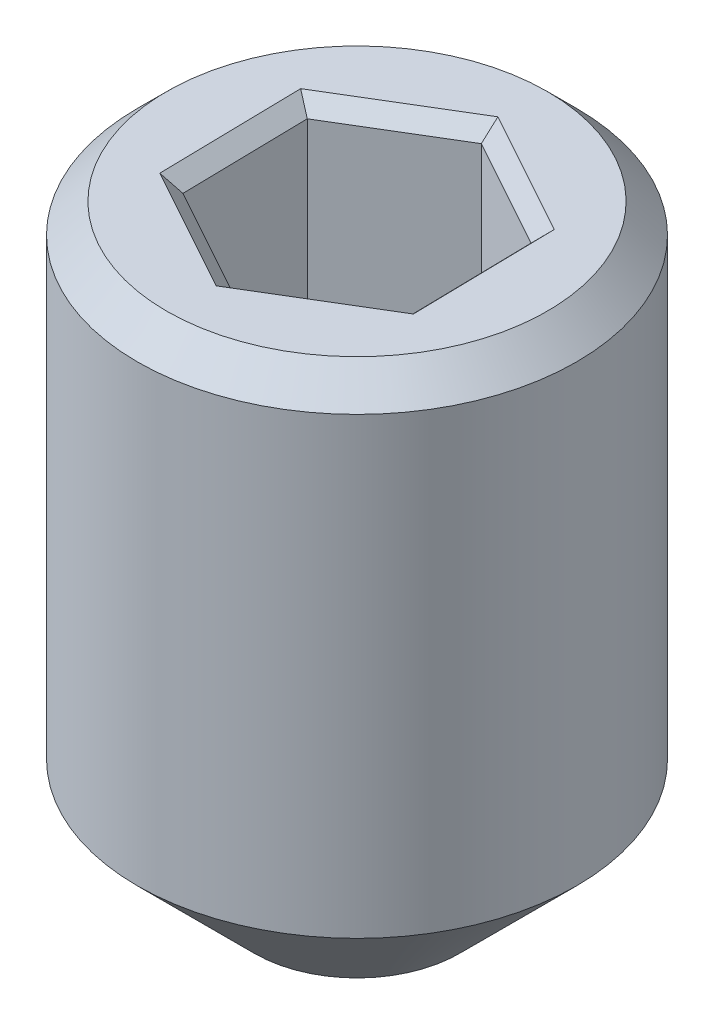
ISO-10303-21;
HEADER;
FILE_DESCRIPTION(('STEP AP214'),'2;1');
FILE_NAME('part.step','',(''),(''),'','','');
FILE_SCHEMA(('AUTOMOTIVE_DESIGN { 1 0 10303 214 1 1 1 1 }'));
ENDSEC;
DATA;
#1=APPLICATION_CONTEXT('core data for automotive mechanical design processes');
#2=APPLICATION_PROTOCOL_DEFINITION('international standard','automotive_design',2000,#1);
#3=PRODUCT_CONTEXT('',#1,'mechanical');
#4=PRODUCT('Part','Part','',(#3));
#5=PRODUCT_RELATED_PRODUCT_CATEGORY('part','',(#4));
#6=PRODUCT_DEFINITION_FORMATION('','',#4);
#7=PRODUCT_DEFINITION_CONTEXT('part definition',#1,'design');
#8=PRODUCT_DEFINITION('design','',#6,#7);
#9=PRODUCT_DEFINITION_SHAPE('','',#8);
#10=(LENGTH_UNIT() NAMED_UNIT(*) SI_UNIT(.MILLI.,.METRE.));
#11=(NAMED_UNIT(*) PLANE_ANGLE_UNIT() SI_UNIT($,.RADIAN.));
#12=(NAMED_UNIT(*) SI_UNIT($,.STERADIAN.) SOLID_ANGLE_UNIT());
#13=UNCERTAINTY_MEASURE_WITH_UNIT(LENGTH_MEASURE(1.E-05),#10,'distance_accuracy_value','');
#14=(GEOMETRIC_REPRESENTATION_CONTEXT(3) GLOBAL_UNCERTAINTY_ASSIGNED_CONTEXT((#13)) GLOBAL_UNIT_ASSIGNED_CONTEXT((#10,
#11,#12)) REPRESENTATION_CONTEXT('',''));
#15=CARTESIAN_POINT('',(0.,0.,0.));
#16=DIRECTION('',(0.,0.,1.));
#17=DIRECTION('',(1.,0.,0.));
#18=AXIS2_PLACEMENT_3D('',#15,#16,#17);
#19=CARTESIAN_POINT('',(0.,4.1,0.));
#20=DIRECTION('',(0.,-1.,0.));
#21=DIRECTION('',(0.,0.,-1.));
#22=AXIS2_PLACEMENT_3D('',#19,#20,#21);
#23=CYLINDRICAL_SURFACE('',#22,1.5);
#24=CARTESIAN_POINT('',(0.,0.799999999999999,0.));
#25=DIRECTION('',(0.,1.,0.));
#26=DIRECTION('',(0.,0.,1.));
#27=AXIS2_PLACEMENT_3D('',#24,#25,#26);
#28=CIRCLE('',#27,1.5);
#29=CARTESIAN_POINT('',(0.,0.799999999999999,1.5));
#30=VERTEX_POINT('',#29);
#31=EDGE_CURVE('E41',#30,#30,#28,.T.);
#32=ORIENTED_EDGE('',*,*,#31,.T.);
#33=EDGE_LOOP('',(#32));
#34=FACE_BOUND('',#33,.T.);
#35=CARTESIAN_POINT('',(0.,3.9,0.));
#36=DIRECTION('',(0.,1.,0.));
#37=DIRECTION('',(0.,0.,1.));
#38=AXIS2_PLACEMENT_3D('',#35,#36,#37);
#39=CIRCLE('',#38,1.5);
#40=CARTESIAN_POINT('',(0.,3.9,1.5));
#41=VERTEX_POINT('',#40);
#42=EDGE_CURVE('E162',#41,#41,#39,.F.);
#43=ORIENTED_EDGE('',*,*,#42,.T.);
#44=EDGE_LOOP('',(#43));
#45=FACE_BOUND('',#44,.T.);
#46=ADVANCED_FACE('F33',(#34,#45),#23,.T.);
#47=CARTESIAN_POINT('',(0.,4.1,0.));
#48=DIRECTION('',(0.,1.,0.));
#49=DIRECTION('',(0.,0.,1.));
#50=AXIS2_PLACEMENT_3D('',#47,#48,#49);
#51=PLANE('',#50);
#52=DIRECTION('',(-0.875489199042184,0.,-0.483237687231113));
#53=VECTOR('',#52,1.);
#54=CARTESIAN_POINT('',(-0.789849977701157,4.1,0.534917762581765));
#55=LINE('',#54,#53);
#56=CARTESIAN_POINT('',(0.018892301882227,4.1,0.981313616670493));
#57=VERTEX_POINT('',#56);
#58=CARTESIAN_POINT('',(-0.840396370175118,4.1,0.50701802170122));
#59=VERTEX_POINT('',#58);
#60=EDGE_CURVE('E176',#57,#59,#55,.T.);
#61=ORIENTED_EDGE('',*,*,#60,.T.);
#62=DIRECTION('',(-0.0192484863129093,0.,-0.999814730724979));
#63=VECTOR('',#62,1.);
#64=CARTESIAN_POINT('',(-0.85817736018192,4.1,-0.416571264576892));
#65=LINE('',#64,#63);
#66=CARTESIAN_POINT('',(-0.859288672057345,4.1,-0.474295594969274));
#67=VERTEX_POINT('',#66);
#68=EDGE_CURVE('E147',#59,#67,#65,.T.);
#69=ORIENTED_EDGE('',*,*,#68,.T.);
#70=DIRECTION('',(0.856240712729275,0.,-0.516577043493866));
#71=VECTOR('',#70,1.);
#72=CARTESIAN_POINT('',(-0.0683273824807632,4.1,-0.951489027158657));
#73=LINE('',#72,#71);
#74=CARTESIAN_POINT('',(-0.0188923018822269,4.1,-0.981313616670493));
#75=VERTEX_POINT('',#74);
#76=EDGE_CURVE('E161',#67,#75,#73,.T.);
#77=ORIENTED_EDGE('',*,*,#76,.T.);
#78=DIRECTION('',(0.875489199042184,0.,0.483237687231113));
#79=VECTOR('',#78,1.);
#80=CARTESIAN_POINT('',(0.789849977701157,4.1,-0.534917762581765));
#81=LINE('',#80,#79);
#82=CARTESIAN_POINT('',(0.840396370175118,4.1,-0.50701802170122));
#83=VERTEX_POINT('',#82);
#84=EDGE_CURVE('E164',#75,#83,#81,.T.);
#85=ORIENTED_EDGE('',*,*,#84,.T.);
#86=DIRECTION('',(0.0192484863129097,0.,0.999814730724979));
#87=VECTOR('',#86,1.);
#88=CARTESIAN_POINT('',(0.85817736018192,4.1,0.416571264576891));
#89=LINE('',#88,#87);
#90=CARTESIAN_POINT('',(0.859288672057346,4.1,0.474295594969273));
#91=VERTEX_POINT('',#90);
#92=EDGE_CURVE('E172',#83,#91,#89,.T.);
#93=ORIENTED_EDGE('',*,*,#92,.T.);
#94=DIRECTION('',(-0.856240712729275,0.,0.516577043493866));
#95=VECTOR('',#94,1.);
#96=CARTESIAN_POINT('',(0.0683273824807633,4.1,0.951489027158657));
#97=LINE('',#96,#95);
#98=EDGE_CURVE('E174',#91,#57,#97,.T.);
#99=ORIENTED_EDGE('',*,*,#98,.T.);
#100=EDGE_LOOP('',(#61,#69,#77,#85,#93,#99));
#101=FACE_BOUND('',#100,.T.);
#102=CARTESIAN_POINT('',(0.,4.1,0.));
#103=DIRECTION('',(0.,1.,0.));
#104=DIRECTION('',(0.,0.,1.));
#105=AXIS2_PLACEMENT_3D('',#102,#103,#104);
#106=CIRCLE('',#105,1.3);
#107=CARTESIAN_POINT('',(0.,4.1,1.3));
#108=VERTEX_POINT('',#107);
#109=EDGE_CURVE('E167',#108,#108,#106,.T.);
#110=ORIENTED_EDGE('',*,*,#109,.T.);
#111=EDGE_LOOP('',(#110));
#112=FACE_BOUND('',#111,.T.);
#113=ADVANCED_FACE('F253',(#101,#112),#51,.T.);
#114=CARTESIAN_POINT('',(0.,0.,0.));
#115=DIRECTION('',(0.,1.,0.));
#116=DIRECTION('',(0.,0.,1.));
#117=AXIS2_PLACEMENT_3D('',#114,#115,#116);
#118=PLANE('',#117);
#119=CARTESIAN_POINT('',(0.,0.,0.));
#120=DIRECTION('',(0.,1.,0.));
#121=DIRECTION('',(0.,0.,1.));
#122=AXIS2_PLACEMENT_3D('',#119,#120,#121);
#123=CIRCLE('',#122,0.699999999999997);
#124=CARTESIAN_POINT('',(0.,0.,0.699999999999997));
#125=VERTEX_POINT('',#124);
#126=EDGE_CURVE('E11',#125,#125,#123,.F.);
#127=ORIENTED_EDGE('',*,*,#126,.T.);
#128=EDGE_LOOP('',(#127));
#129=FACE_BOUND('',#128,.T.);
#130=ADVANCED_FACE('F258',(#129),#118,.F.);
#131=CARTESIAN_POINT('',(0.0166696781313767,2.1,0.865864955885729));
#132=DIRECTION('',(0.516577043493866,0.,0.856240712729275));
#133=DIRECTION('',(0.856240712729275,0.,-0.516577043493866));
#134=AXIS2_PLACEMENT_3D('',#131,#132,#133);
#135=PLANE('',#134);
#136=DIRECTION('',(0.,1.,0.));
#137=VECTOR('',#136,1.);
#138=CARTESIAN_POINT('',(0.758195887109423,2.1,0.418496113208182));
#139=LINE('',#138,#137);
#140=CARTESIAN_POINT('',(0.758195887109423,2.7,0.418496113208182));
#141=VERTEX_POINT('',#140);
#142=CARTESIAN_POINT('',(0.758195887109423,4.,0.418496113208182));
#143=VERTEX_POINT('',#142);
#144=EDGE_CURVE('E201',#141,#143,#139,.T.);
#145=ORIENTED_EDGE('',*,*,#144,.F.);
#146=DIRECTION('',(0.856240712729275,0.,-0.516577043493866));
#147=VECTOR('',#146,1.);
#148=CARTESIAN_POINT('',(0.0166696781313767,2.7,0.865864955885729));
#149=LINE('',#148,#147);
#150=CARTESIAN_POINT('',(0.0166696781313767,2.7,0.865864955885729));
#151=VERTEX_POINT('',#150);
#152=EDGE_CURVE('E217',#141,#151,#149,.F.);
#153=ORIENTED_EDGE('',*,*,#152,.T.);
#154=DIRECTION('',(0.,1.,0.));
#155=VECTOR('',#154,1.);
#156=CARTESIAN_POINT('',(0.0166696781313767,2.1,0.865864955885729));
#157=LINE('',#156,#155);
#158=CARTESIAN_POINT('',(0.0166696781313767,4.,0.865864955885729));
#159=VERTEX_POINT('',#158);
#160=EDGE_CURVE('E136',#151,#159,#157,.T.);
#161=ORIENTED_EDGE('',*,*,#160,.T.);
#162=DIRECTION('',(0.856240712729275,0.,-0.516577043493866));
#163=VECTOR('',#162,1.);
#164=CARTESIAN_POINT('',(0.758195887109423,4.,0.418496113208182));
#165=LINE('',#164,#163);
#166=EDGE_CURVE('E157',#159,#143,#165,.T.);
#167=ORIENTED_EDGE('',*,*,#166,.T.);
#168=EDGE_LOOP('',(#145,#153,#161,#167));
#169=FACE_BOUND('',#168,.T.);
#170=ADVANCED_FACE('F316',(#169),#135,.F.);
#171=CARTESIAN_POINT('',(-0.741526208978046,2.1,0.447368842677547));
#172=DIRECTION('',(-0.483237687231113,0.,0.875489199042184));
#173=DIRECTION('',(0.875489199042184,0.,0.483237687231113));
#174=AXIS2_PLACEMENT_3D('',#171,#172,#173);
#175=PLANE('',#174);
#176=ORIENTED_EDGE('',*,*,#160,.F.);
#177=DIRECTION('',(0.875489199042184,0.,0.483237687231113));
#178=VECTOR('',#177,1.);
#179=CARTESIAN_POINT('',(-0.741526208978046,2.7,0.447368842677547));
#180=LINE('',#179,#178);
#181=CARTESIAN_POINT('',(-0.741526208978046,2.7,0.447368842677547));
#182=VERTEX_POINT('',#181);
#183=EDGE_CURVE('E131',#151,#182,#180,.F.);
#184=ORIENTED_EDGE('',*,*,#183,.T.);
#185=DIRECTION('',(0.,1.,0.));
#186=VECTOR('',#185,1.);
#187=CARTESIAN_POINT('',(-0.741526208978046,2.1,0.447368842677547));
#188=LINE('',#187,#186);
#189=CARTESIAN_POINT('',(-0.741526208978046,4.,0.447368842677547));
#190=VERTEX_POINT('',#189);
#191=EDGE_CURVE('E123',#182,#190,#188,.T.);
#192=ORIENTED_EDGE('',*,*,#191,.T.);
#193=DIRECTION('',(0.875489199042184,0.,0.483237687231113));
#194=VECTOR('',#193,1.);
#195=CARTESIAN_POINT('',(0.0166696781313767,4.,0.865864955885729));
#196=LINE('',#195,#194);
#197=EDGE_CURVE('E128',#190,#159,#196,.T.);
#198=ORIENTED_EDGE('',*,*,#197,.T.);
#199=EDGE_LOOP('',(#176,#184,#192,#198));
#200=FACE_BOUND('',#199,.T.);
#201=ADVANCED_FACE('F126',(#200),#175,.F.);
#202=CARTESIAN_POINT('',(-0.758195887109422,2.1,-0.418496113208182));
#203=DIRECTION('',(-0.999814730724979,0.,0.0192484863129093));
#204=DIRECTION('',(0.0192484863129093,0.,0.999814730724979));
#205=AXIS2_PLACEMENT_3D('',#202,#203,#204);
#206=PLANE('',#205);
#207=ORIENTED_EDGE('',*,*,#191,.F.);
#208=DIRECTION('',(0.0192484863129093,0.,0.999814730724979));
#209=VECTOR('',#208,1.);
#210=CARTESIAN_POINT('',(-0.758195887109422,2.7,-0.418496113208182));
#211=LINE('',#210,#209);
#212=CARTESIAN_POINT('',(-0.758195887109422,2.7,-0.418496113208182));
#213=VERTEX_POINT('',#212);
#214=EDGE_CURVE('E214',#182,#213,#211,.F.);
#215=ORIENTED_EDGE('',*,*,#214,.T.);
#216=DIRECTION('',(0.,1.,0.));
#217=VECTOR('',#216,1.);
#218=CARTESIAN_POINT('',(-0.758195887109422,2.1,-0.418496113208182));
#219=LINE('',#218,#217);
#220=CARTESIAN_POINT('',(-0.758195887109422,4.,-0.418496113208182));
#221=VERTEX_POINT('',#220);
#222=EDGE_CURVE('E137',#213,#221,#219,.T.);
#223=ORIENTED_EDGE('',*,*,#222,.T.);
#224=DIRECTION('',(0.0192484863129093,0.,0.999814730724979));
#225=VECTOR('',#224,1.);
#226=CARTESIAN_POINT('',(-0.741526208978046,4.,0.447368842677547));
#227=LINE('',#226,#225);
#228=EDGE_CURVE('E145',#221,#190,#227,.T.);
#229=ORIENTED_EDGE('',*,*,#228,.T.);
#230=EDGE_LOOP('',(#207,#215,#223,#229));
#231=FACE_BOUND('',#230,.T.);
#232=ADVANCED_FACE('F159',(#231),#206,.F.);
#233=CARTESIAN_POINT('',(-0.0166696781313765,2.1,-0.865864955885729));
#234=DIRECTION('',(-0.516577043493866,0.,-0.856240712729275));
#235=DIRECTION('',(-0.856240712729275,0.,0.516577043493866));
#236=AXIS2_PLACEMENT_3D('',#233,#234,#235);
#237=PLANE('',#236);
#238=ORIENTED_EDGE('',*,*,#222,.F.);
#239=DIRECTION('',(-0.856240712729275,0.,0.516577043493866));
#240=VECTOR('',#239,1.);
#241=CARTESIAN_POINT('',(-0.0166696781313765,2.7,-0.865864955885729));
#242=LINE('',#241,#240);
#243=CARTESIAN_POINT('',(-0.0166696781313765,2.7,-0.865864955885729));
#244=VERTEX_POINT('',#243);
#245=EDGE_CURVE('E48',#213,#244,#242,.F.);
#246=ORIENTED_EDGE('',*,*,#245,.T.);
#247=DIRECTION('',(0.,1.,0.));
#248=VECTOR('',#247,1.);
#249=CARTESIAN_POINT('',(-0.0166696781313765,2.1,-0.865864955885729));
#250=LINE('',#249,#248);
#251=CARTESIAN_POINT('',(-0.0166696781313765,4.,-0.865864955885729));
#252=VERTEX_POINT('',#251);
#253=EDGE_CURVE('E321',#244,#252,#250,.T.);
#254=ORIENTED_EDGE('',*,*,#253,.T.);
#255=DIRECTION('',(-0.856240712729275,0.,0.516577043493866));
#256=VECTOR('',#255,1.);
#257=CARTESIAN_POINT('',(-0.758195887109422,4.,-0.418496113208182));
#258=LINE('',#257,#256);
#259=EDGE_CURVE('E187',#252,#221,#258,.T.);
#260=ORIENTED_EDGE('',*,*,#259,.T.);
#261=EDGE_LOOP('',(#238,#246,#254,#260));
#262=FACE_BOUND('',#261,.T.);
#263=ADVANCED_FACE('F346',(#262),#237,.F.);
#264=CARTESIAN_POINT('',(0.741526208978046,2.1,-0.447368842677547));
#265=DIRECTION('',(0.483237687231113,0.,-0.875489199042184));
#266=DIRECTION('',(-0.875489199042184,0.,-0.483237687231113));
#267=AXIS2_PLACEMENT_3D('',#264,#265,#266);
#268=PLANE('',#267);
#269=ORIENTED_EDGE('',*,*,#253,.F.);
#270=DIRECTION('',(-0.875489199042184,0.,-0.483237687231113));
#271=VECTOR('',#270,1.);
#272=CARTESIAN_POINT('',(0.741526208978046,2.7,-0.447368842677547));
#273=LINE('',#272,#271);
#274=CARTESIAN_POINT('',(0.741526208978046,2.7,-0.447368842677547));
#275=VERTEX_POINT('',#274);
#276=EDGE_CURVE('E55',#244,#275,#273,.F.);
#277=ORIENTED_EDGE('',*,*,#276,.T.);
#278=DIRECTION('',(0.,1.,0.));
#279=VECTOR('',#278,1.);
#280=CARTESIAN_POINT('',(0.741526208978046,2.1,-0.447368842677547));
#281=LINE('',#280,#279);
#282=CARTESIAN_POINT('',(0.741526208978046,4.,-0.447368842677547));
#283=VERTEX_POINT('',#282);
#284=EDGE_CURVE('E323',#275,#283,#281,.T.);
#285=ORIENTED_EDGE('',*,*,#284,.T.);
#286=DIRECTION('',(-0.875489199042184,0.,-0.483237687231113));
#287=VECTOR('',#286,1.);
#288=CARTESIAN_POINT('',(-0.0166696781313765,4.,-0.865864955885729));
#289=LINE('',#288,#287);
#290=EDGE_CURVE('E184',#283,#252,#289,.T.);
#291=ORIENTED_EDGE('',*,*,#290,.T.);
#292=EDGE_LOOP('',(#269,#277,#285,#291));
#293=FACE_BOUND('',#292,.T.);
#294=ADVANCED_FACE('F337',(#293),#268,.F.);
#295=CARTESIAN_POINT('',(0.758195887109423,2.1,0.418496113208182));
#296=DIRECTION('',(0.999814730724979,0.,-0.0192484863129097));
#297=DIRECTION('',(-0.0192484863129097,0.,-0.999814730724979));
#298=AXIS2_PLACEMENT_3D('',#295,#296,#297);
#299=PLANE('',#298);
#300=ORIENTED_EDGE('',*,*,#284,.F.);
#301=DIRECTION('',(-0.0192484863129097,0.,-0.999814730724979));
#302=VECTOR('',#301,1.);
#303=CARTESIAN_POINT('',(0.758195887109423,2.7,0.418496113208182));
#304=LINE('',#303,#302);
#305=EDGE_CURVE('E219',#275,#141,#304,.F.);
#306=ORIENTED_EDGE('',*,*,#305,.T.);
#307=ORIENTED_EDGE('',*,*,#144,.T.);
#308=DIRECTION('',(-0.0192484863129097,0.,-0.999814730724979));
#309=VECTOR('',#308,1.);
#310=CARTESIAN_POINT('',(0.741526208978046,4.,-0.447368842677547));
#311=LINE('',#310,#309);
#312=EDGE_CURVE('E181',#143,#283,#311,.T.);
#313=ORIENTED_EDGE('',*,*,#312,.T.);
#314=EDGE_LOOP('',(#300,#306,#307,#313));
#315=FACE_BOUND('',#314,.T.);
#316=ADVANCED_FACE('F326',(#315),#299,.F.);
#317=CARTESIAN_POINT('',(0.758195887109423,2.1,0.418496113208182));
#318=DIRECTION('',(0.,1.,0.));
#319=DIRECTION('',(0.,0.,1.));
#320=AXIS2_PLACEMENT_3D('',#317,#318,#319);
#321=PLANE('',#320);
#322=DIRECTION('',(-0.856240712729275,0.,0.516577043493866));
#323=VECTOR('',#322,1.);
#324=CARTESIAN_POINT('',(0.293276547964943,2.1,-0.352120528248165));
#325=LINE('',#324,#323);
#326=CARTESIAN_POINT('',(-0.00333393562627531,2.1,-0.173172991177146));
#327=VERTEX_POINT('',#326);
#328=CARTESIAN_POINT('',(-0.151639177421885,2.1,-0.0836992226416365));
#329=VERTEX_POINT('',#328);
#330=EDGE_CURVE('E188',#327,#329,#325,.T.);
#331=ORIENTED_EDGE('',*,*,#330,.T.);
#332=DIRECTION('',(0.0192484863129093,0.,0.999814730724979));
#333=VECTOR('',#332,1.);
#334=CARTESIAN_POINT('',(-0.141637370543058,2.1,0.435819750889801));
#335=LINE('',#334,#333);
#336=CARTESIAN_POINT('',(-0.148305241795609,2.1,0.0894737685355091));
#337=VERTEX_POINT('',#336);
#338=EDGE_CURVE('E211',#329,#337,#335,.T.);
#339=ORIENTED_EDGE('',*,*,#338,.T.);
#340=DIRECTION('',(0.875489199042184,0.,0.483237687231113));
#341=VECTOR('',#340,1.);
#342=CARTESIAN_POINT('',(0.685710234024756,2.1,0.54981949306451));
#343=LINE('',#342,#341);
#344=CARTESIAN_POINT('',(0.00333393562627543,2.1,0.173172991177146));
#345=VERTEX_POINT('',#344);
#346=EDGE_CURVE('E209',#337,#345,#343,.T.);
#347=ORIENTED_EDGE('',*,*,#346,.T.);
#348=DIRECTION('',(0.856240712729275,0.,-0.516577043493866));
#349=VECTOR('',#348,1.);
#350=CARTESIAN_POINT('',(0.448249661013103,2.1,-0.0952483144293826));
#351=LINE('',#350,#349);
#352=CARTESIAN_POINT('',(0.151639177421885,2.1,0.0836992226416362));
#353=VERTEX_POINT('',#352);
#354=EDGE_CURVE('E207',#345,#353,#351,.T.);
#355=ORIENTED_EDGE('',*,*,#354,.T.);
#356=DIRECTION('',(-0.0192484863129097,0.,-0.999814730724979));
#357=VECTOR('',#356,1.);
#358=CARTESIAN_POINT('',(0.158307048674435,2.1,0.430045204995928));
#359=LINE('',#358,#357);
#360=CARTESIAN_POINT('',(0.148305241795609,2.1,-0.0894737685355093));
#361=VERTEX_POINT('',#360);
#362=EDGE_CURVE('E205',#353,#361,#359,.T.);
#363=ORIENTED_EDGE('',*,*,#362,.T.);
#364=DIRECTION('',(-0.875489199042184,0.,-0.483237687231113));
#365=VECTOR('',#364,1.);
#366=CARTESIAN_POINT('',(0.830681540194089,2.1,0.287172733351855));
#367=LINE('',#366,#365);
#368=EDGE_CURVE('E203',#361,#327,#367,.T.);
#369=ORIENTED_EDGE('',*,*,#368,.T.);
#370=EDGE_LOOP('',(#331,#339,#347,#355,#363,#369));
#371=FACE_BOUND('',#370,.T.);
#372=ADVANCED_FACE('F267',(#371),#321,.T.);
#373=CARTESIAN_POINT('',(0.,4.1,0.));
#374=DIRECTION('',(0.,-1.,0.));
#375=DIRECTION('',(0.,0.,-1.));
#376=AXIS2_PLACEMENT_3D('',#373,#374,#375);
#377=CONICAL_SURFACE('',#376,1.3,0.785398163397443);
#378=ORIENTED_EDGE('',*,*,#42,.F.);
#379=EDGE_LOOP('',(#378));
#380=FACE_BOUND('',#379,.T.);
#381=ORIENTED_EDGE('',*,*,#109,.F.);
#382=EDGE_LOOP('',(#381));
#383=FACE_BOUND('',#382,.T.);
#384=ADVANCED_FACE('F263',(#380,#383),#377,.T.);
#385=CARTESIAN_POINT('',(0.758195887109423,4.,0.418496113208182));
#386=DIRECTION('',(-0.706975776025836,0.707106781186546,0.0136107351994349));
#387=DIRECTION('',(-0.707172286800526,-0.707041269503638,0.));
#388=AXIS2_PLACEMENT_3D('',#385,#386,#387);
#389=PLANE('',#388);
#390=DIRECTION('',(0.661807627482498,0.654653670707978,0.365293355585011));
#391=VECTOR('',#390,1.);
#392=CARTESIAN_POINT('',(0.541568490792446,3.78571428571429,0.298925795148702));
#393=LINE('',#392,#391);
#394=EDGE_CURVE('E195',#91,#143,#393,.F.);
#395=ORIENTED_EDGE('',*,*,#394,.F.);
#396=ORIENTED_EDGE('',*,*,#92,.F.);
#397=DIRECTION('',(0.647257139511529,0.654653670707978,-0.390495540025648));
#398=VECTOR('',#397,1.);
#399=CARTESIAN_POINT('',(0.529661577841462,3.78571428571428,-0.319549173341104));
#400=LINE('',#399,#398);
#401=EDGE_CURVE('E198',#283,#83,#400,.T.);
#402=ORIENTED_EDGE('',*,*,#401,.F.);
#403=ORIENTED_EDGE('',*,*,#312,.F.);
#404=EDGE_LOOP('',(#395,#396,#402,#403));
#405=FACE_BOUND('',#404,.T.);
#406=ADVANCED_FACE('F266',(#405),#389,.T.);
#407=CARTESIAN_POINT('',(0.741526208978046,4.,-0.447368842677547));
#408=DIRECTION('',(-0.341700645566024,0.707106781186547,0.619064349498308));
#409=DIRECTION('',(0.,-0.658713047341894,0.752394259189659));
#410=AXIS2_PLACEMENT_3D('',#407,#408,#409);
#411=PLANE('',#410);
#412=ORIENTED_EDGE('',*,*,#401,.T.);
#413=ORIENTED_EDGE('',*,*,#84,.F.);
#414=DIRECTION('',(-0.0145504879709682,0.654653670707978,-0.755788895610657));
#415=VECTOR('',#414,1.);
#416=CARTESIAN_POINT('',(-0.0119069129509834,3.78571428571429,-0.618474968489807));
#417=LINE('',#416,#415);
#418=EDGE_CURVE('E192',#252,#75,#417,.T.);
#419=ORIENTED_EDGE('',*,*,#418,.F.);
#420=ORIENTED_EDGE('',*,*,#290,.F.);
#421=EDGE_LOOP('',(#412,#413,#419,#420));
#422=FACE_BOUND('',#421,.T.);
#423=ADVANCED_FACE('F281',(#422),#411,.T.);
#424=CARTESIAN_POINT('',(0.0166696781313767,4.,0.865864955885729));
#425=DIRECTION('',(-0.365275130459811,0.707106781186547,-0.605453614298873));
#426=DIRECTION('',(0.,0.650396250554211,0.759595100869551));
#427=AXIS2_PLACEMENT_3D('',#424,#425,#426);
#428=PLANE('',#427);
#429=ORIENTED_EDGE('',*,*,#394,.T.);
#430=ORIENTED_EDGE('',*,*,#166,.F.);
#431=DIRECTION('',(0.0145504879709687,0.654653670707978,0.755788895610657));
#432=VECTOR('',#431,1.);
#433=CARTESIAN_POINT('',(0.0119069129509832,3.78571428571428,0.618474968489807));
#434=LINE('',#433,#432);
#435=EDGE_CURVE('E156',#57,#159,#434,.F.);
#436=ORIENTED_EDGE('',*,*,#435,.F.);
#437=ORIENTED_EDGE('',*,*,#98,.F.);
#438=EDGE_LOOP('',(#429,#430,#436,#437));
#439=FACE_BOUND('',#438,.T.);
#440=ADVANCED_FACE('F277',(#439),#428,.T.);
#441=CARTESIAN_POINT('',(-0.0166696781313765,4.,-0.865864955885729));
#442=DIRECTION('',(0.365275130459811,0.707106781186547,0.605453614298873));
#443=DIRECTION('',(0.,-0.650396250554211,0.759595100869551));
#444=AXIS2_PLACEMENT_3D('',#441,#442,#443);
#445=PLANE('',#444);
#446=ORIENTED_EDGE('',*,*,#418,.T.);
#447=ORIENTED_EDGE('',*,*,#76,.F.);
#448=DIRECTION('',(0.661807627482498,-0.654653670707978,0.36529335558501));
#449=VECTOR('',#448,1.);
#450=CARTESIAN_POINT('',(-0.758195887109422,4.,-0.418496113208183));
#451=LINE('',#450,#449);
#452=EDGE_CURVE('E150',#221,#67,#451,.F.);
#453=ORIENTED_EDGE('',*,*,#452,.F.);
#454=ORIENTED_EDGE('',*,*,#259,.F.);
#455=EDGE_LOOP('',(#446,#447,#453,#454));
#456=FACE_BOUND('',#455,.T.);
#457=ADVANCED_FACE('F274',(#456),#445,.T.);
#458=CARTESIAN_POINT('',(-0.741526208978046,4.,0.447368842677547));
#459=DIRECTION('',(0.341700645566024,0.707106781186547,-0.619064349498308));
#460=DIRECTION('',(0.,0.658713047341894,0.752394259189659));
#461=AXIS2_PLACEMENT_3D('',#458,#459,#460);
#462=PLANE('',#461);
#463=ORIENTED_EDGE('',*,*,#435,.T.);
#464=ORIENTED_EDGE('',*,*,#197,.F.);
#465=DIRECTION('',(-0.64725713951153,0.654653670707978,0.390495540025647));
#466=VECTOR('',#465,1.);
#467=CARTESIAN_POINT('',(-0.529661577841462,3.78571428571429,0.319549173341105));
#468=LINE('',#467,#466);
#469=EDGE_CURVE('E143',#59,#190,#468,.F.);
#470=ORIENTED_EDGE('',*,*,#469,.F.);
#471=ORIENTED_EDGE('',*,*,#60,.F.);
#472=EDGE_LOOP('',(#463,#464,#470,#471));
#473=FACE_BOUND('',#472,.T.);
#474=ADVANCED_FACE('F154',(#473),#462,.T.);
#475=CARTESIAN_POINT('',(-0.758195887109422,4.,-0.418496113208182));
#476=DIRECTION('',(0.706975776025835,0.707106781186547,-0.0136107351994347));
#477=DIRECTION('',(-0.707172286800526,0.707041269503637,0.));
#478=AXIS2_PLACEMENT_3D('',#475,#476,#477);
#479=PLANE('',#478);
#480=ORIENTED_EDGE('',*,*,#452,.T.);
#481=ORIENTED_EDGE('',*,*,#68,.F.);
#482=ORIENTED_EDGE('',*,*,#469,.T.);
#483=ORIENTED_EDGE('',*,*,#228,.F.);
#484=EDGE_LOOP('',(#480,#481,#482,#483));
#485=FACE_BOUND('',#484,.T.);
#486=ADVANCED_FACE('F144',(#485),#479,.T.);
#487=CARTESIAN_POINT('',(0.158307048674435,2.7,0.430045204995928));
#488=DIRECTION('',(-0.0192484863129097,0.,-0.999814730724979));
#489=DIRECTION('',(-0.999814730724979,0.,0.0192484863129097));
#490=AXIS2_PLACEMENT_3D('',#487,#488,#489);
#491=CYLINDRICAL_SURFACE('',#490,0.6);
#492=CARTESIAN_POINT('',(0.151639177421885,2.7,0.0836992226416362));
#493=DIRECTION('',(0.483237687231113,0.,-0.875489199042184));
#494=DIRECTION('',(0.875489199042184,0.,0.483237687231112));
#495=AXIS2_PLACEMENT_3D('',#492,#493,#494);
#496=ELLIPSE('',#495,0.692820323027551,0.6);
#497=EDGE_CURVE('E233',#141,#353,#496,.T.);
#498=ORIENTED_EDGE('',*,*,#497,.F.);
#499=ORIENTED_EDGE('',*,*,#305,.F.);
#500=CARTESIAN_POINT('',(0.148305241795609,2.7,-0.0894737685355093));
#501=DIRECTION('',(-0.516577043493866,0.,-0.856240712729275));
#502=DIRECTION('',(0.856240712729275,0.,-0.516577043493866));
#503=AXIS2_PLACEMENT_3D('',#500,#501,#502);
#504=ELLIPSE('',#503,0.692820323027551,0.6);
#505=EDGE_CURVE('E151',#361,#275,#504,.F.);
#506=ORIENTED_EDGE('',*,*,#505,.F.);
#507=ORIENTED_EDGE('',*,*,#362,.F.);
#508=EDGE_LOOP('',(#498,#499,#506,#507));
#509=FACE_BOUND('',#508,.T.);
#510=ADVANCED_FACE('F271',(#509),#491,.F.);
#511=CARTESIAN_POINT('',(0.830681540194089,2.7,0.287172733351855));
#512=DIRECTION('',(-0.875489199042184,0.,-0.483237687231113));
#513=DIRECTION('',(-0.483237687231113,0.,0.875489199042184));
#514=AXIS2_PLACEMENT_3D('',#511,#512,#513);
#515=CYLINDRICAL_SURFACE('',#514,0.6);
#516=ORIENTED_EDGE('',*,*,#505,.T.);
#517=ORIENTED_EDGE('',*,*,#276,.F.);
#518=CARTESIAN_POINT('',(-0.00333393562627522,2.7,-0.173172991177146));
#519=DIRECTION('',(-0.999814730724979,0.,0.0192484863129096));
#520=DIRECTION('',(-0.0192484863129094,0.,-0.999814730724979));
#521=AXIS2_PLACEMENT_3D('',#518,#519,#520);
#522=ELLIPSE('',#521,0.692820323027551,0.6);
#523=EDGE_CURVE('E230',#327,#244,#522,.F.);
#524=ORIENTED_EDGE('',*,*,#523,.F.);
#525=ORIENTED_EDGE('',*,*,#368,.F.);
#526=EDGE_LOOP('',(#516,#517,#524,#525));
#527=FACE_BOUND('',#526,.T.);
#528=ADVANCED_FACE('F299',(#527),#515,.F.);
#529=CARTESIAN_POINT('',(0.448249661013103,2.7,-0.0952483144293826));
#530=DIRECTION('',(0.856240712729275,0.,-0.516577043493866));
#531=DIRECTION('',(-0.516577043493866,0.,-0.856240712729275));
#532=AXIS2_PLACEMENT_3D('',#529,#530,#531);
#533=CYLINDRICAL_SURFACE('',#532,0.6);
#534=ORIENTED_EDGE('',*,*,#497,.T.);
#535=ORIENTED_EDGE('',*,*,#354,.F.);
#536=CARTESIAN_POINT('',(0.00333393562627557,2.7,0.173172991177146));
#537=DIRECTION('',(0.999814730724979,0.,-0.0192484863129096));
#538=DIRECTION('',(0.0192484863129097,0.,0.999814730724979));
#539=AXIS2_PLACEMENT_3D('',#536,#537,#538);
#540=ELLIPSE('',#539,0.692820323027551,0.6);
#541=EDGE_CURVE('E227',#151,#345,#540,.T.);
#542=ORIENTED_EDGE('',*,*,#541,.F.);
#543=ORIENTED_EDGE('',*,*,#152,.F.);
#544=EDGE_LOOP('',(#534,#535,#542,#543));
#545=FACE_BOUND('',#544,.T.);
#546=ADVANCED_FACE('F295',(#545),#533,.F.);
#547=CARTESIAN_POINT('',(0.293276547964943,2.7,-0.352120528248165));
#548=DIRECTION('',(-0.856240712729275,0.,0.516577043493866));
#549=DIRECTION('',(0.516577043493866,0.,0.856240712729275));
#550=AXIS2_PLACEMENT_3D('',#547,#548,#549);
#551=CYLINDRICAL_SURFACE('',#550,0.6);
#552=ORIENTED_EDGE('',*,*,#523,.T.);
#553=ORIENTED_EDGE('',*,*,#245,.F.);
#554=CARTESIAN_POINT('',(-0.151639177421885,2.7,-0.0836992226416363));
#555=DIRECTION('',(-0.483237687231113,0.,0.875489199042184));
#556=DIRECTION('',(0.875489199042184,0.,0.483237687231113));
#557=AXIS2_PLACEMENT_3D('',#554,#555,#556);
#558=ELLIPSE('',#557,0.692820323027551,0.6);
#559=EDGE_CURVE('E225',#329,#213,#558,.F.);
#560=ORIENTED_EDGE('',*,*,#559,.F.);
#561=ORIENTED_EDGE('',*,*,#330,.F.);
#562=EDGE_LOOP('',(#552,#553,#560,#561));
#563=FACE_BOUND('',#562,.T.);
#564=ADVANCED_FACE('F291',(#563),#551,.F.);
#565=CARTESIAN_POINT('',(0.685710234024756,2.7,0.54981949306451));
#566=DIRECTION('',(0.875489199042184,0.,0.483237687231113));
#567=DIRECTION('',(0.483237687231113,0.,-0.875489199042184));
#568=AXIS2_PLACEMENT_3D('',#565,#566,#567);
#569=CYLINDRICAL_SURFACE('',#568,0.6);
#570=ORIENTED_EDGE('',*,*,#541,.T.);
#571=ORIENTED_EDGE('',*,*,#346,.F.);
#572=CARTESIAN_POINT('',(-0.148305241795609,2.7,0.089473768535509));
#573=DIRECTION('',(0.516577043493866,0.,0.856240712729275));
#574=DIRECTION('',(-0.856240712729275,0.,0.516577043493866));
#575=AXIS2_PLACEMENT_3D('',#572,#573,#574);
#576=ELLIPSE('',#575,0.692820323027551,0.6);
#577=EDGE_CURVE('E223',#182,#337,#576,.T.);
#578=ORIENTED_EDGE('',*,*,#577,.F.);
#579=ORIENTED_EDGE('',*,*,#183,.F.);
#580=EDGE_LOOP('',(#570,#571,#578,#579));
#581=FACE_BOUND('',#580,.T.);
#582=ADVANCED_FACE('F248',(#581),#569,.F.);
#583=CARTESIAN_POINT('',(-0.141637370543059,2.7,0.435819750889801));
#584=DIRECTION('',(0.0192484863129093,0.,0.999814730724979));
#585=DIRECTION('',(0.999814730724979,0.,-0.0192484863129093));
#586=AXIS2_PLACEMENT_3D('',#583,#584,#585);
#587=CYLINDRICAL_SURFACE('',#586,0.6);
#588=ORIENTED_EDGE('',*,*,#559,.T.);
#589=ORIENTED_EDGE('',*,*,#214,.F.);
#590=ORIENTED_EDGE('',*,*,#577,.T.);
#591=ORIENTED_EDGE('',*,*,#338,.F.);
#592=EDGE_LOOP('',(#588,#589,#590,#591));
#593=FACE_BOUND('',#592,.T.);
#594=ADVANCED_FACE('F243',(#593),#587,.F.);
#595=CARTESIAN_POINT('',(0.,0.799999999999999,0.));
#596=DIRECTION('',(0.,1.,0.));
#597=DIRECTION('',(0.,0.,1.));
#598=AXIS2_PLACEMENT_3D('',#595,#596,#597);
#599=CONICAL_SURFACE('',#598,1.5,0.78539816339745);
#600=ORIENTED_EDGE('',*,*,#126,.F.);
#601=EDGE_LOOP('',(#600));
#602=FACE_BOUND('',#601,.T.);
#603=ORIENTED_EDGE('',*,*,#31,.F.);
#604=EDGE_LOOP('',(#603));
#605=FACE_BOUND('',#604,.T.);
#606=ADVANCED_FACE('F35',(#602,#605),#599,.T.);
#607=CLOSED_SHELL('',(#46,#113,#130,#170,#201,#232,#263,#294,#316,#372,#384,#406,#423,#440,#457,
#474,#486,#510,#528,#546,#564,#582,#594,#606));
#608=MANIFOLD_SOLID_BREP('B2',#607);
#609=ADVANCED_BREP_SHAPE_REPRESENTATION('',(#18,#608),#14);
#610=SHAPE_DEFINITION_REPRESENTATION(#9,#609);
ENDSEC;
END-ISO-10303-21;
